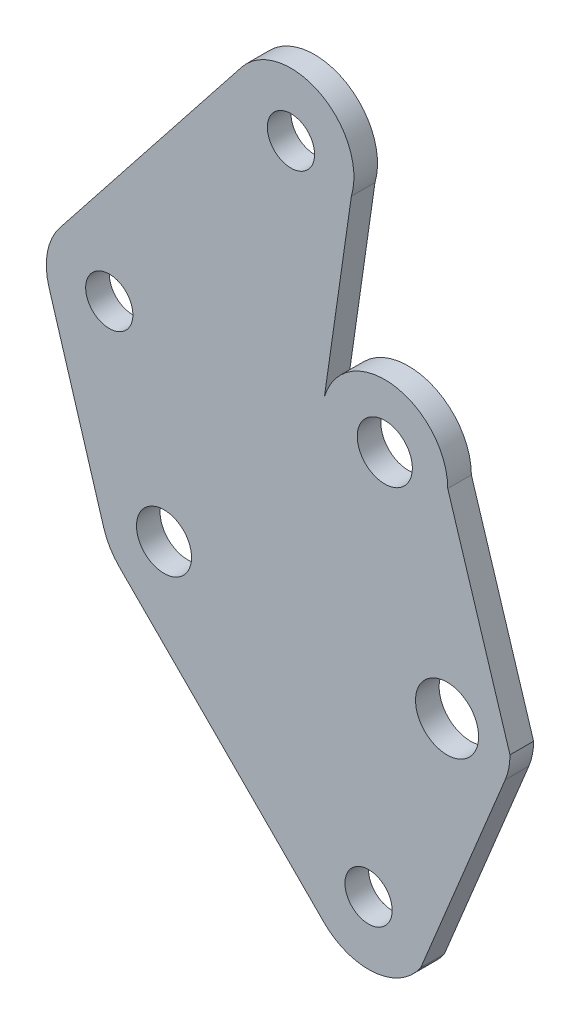
ISO-10303-21;
HEADER;
FILE_DESCRIPTION(('STEP AP214'),'2;1');
FILE_NAME('part.step','',(''),(''),'','','');
FILE_SCHEMA(('AUTOMOTIVE_DESIGN { 1 0 10303 214 1 1 1 1 }'));
ENDSEC;
DATA;
#1=APPLICATION_CONTEXT('core data for automotive mechanical design processes');
#2=APPLICATION_PROTOCOL_DEFINITION('international standard','automotive_design',2000,#1);
#3=PRODUCT_CONTEXT('',#1,'mechanical');
#4=PRODUCT('Part','Part','',(#3));
#5=PRODUCT_RELATED_PRODUCT_CATEGORY('part','',(#4));
#6=PRODUCT_DEFINITION_FORMATION('','',#4);
#7=PRODUCT_DEFINITION_CONTEXT('part definition',#1,'design');
#8=PRODUCT_DEFINITION('design','',#6,#7);
#9=PRODUCT_DEFINITION_SHAPE('','',#8);
#10=(LENGTH_UNIT() NAMED_UNIT(*) SI_UNIT(.MILLI.,.METRE.));
#11=(NAMED_UNIT(*) PLANE_ANGLE_UNIT() SI_UNIT($,.RADIAN.));
#12=(NAMED_UNIT(*) SI_UNIT($,.STERADIAN.) SOLID_ANGLE_UNIT());
#13=UNCERTAINTY_MEASURE_WITH_UNIT(LENGTH_MEASURE(1.E-05),#10,'distance_accuracy_value','');
#14=(GEOMETRIC_REPRESENTATION_CONTEXT(3) GLOBAL_UNCERTAINTY_ASSIGNED_CONTEXT((#13)) GLOBAL_UNIT_ASSIGNED_CONTEXT((#10,
#11,#12)) REPRESENTATION_CONTEXT('',''));
#15=CARTESIAN_POINT('',(0.,0.,0.));
#16=DIRECTION('',(0.,0.,1.));
#17=DIRECTION('',(1.,0.,0.));
#18=AXIS2_PLACEMENT_3D('',#15,#16,#17);
#19=CARTESIAN_POINT('',(480.966099188787,-500.48321627887,1.5));
#20=DIRECTION('',(0.,0.,1.));
#21=DIRECTION('',(1.,0.,0.));
#22=AXIS2_PLACEMENT_3D('',#19,#20,#21);
#23=PLANE('',#22);
#24=CARTESIAN_POINT('',(480.966099188787,-500.48321627887,1.5));
#25=DIRECTION('',(0.,0.,1.));
#26=DIRECTION('',(1.,0.,0.));
#27=AXIS2_PLACEMENT_3D('',#24,#25,#26);
#28=CIRCLE('',#27,1.49999999997758);
#29=CARTESIAN_POINT('',(482.466099188765,-500.48321627887,1.5));
#30=VERTEX_POINT('',#29);
#31=EDGE_CURVE('E340',#30,#30,#28,.T.);
#32=ORIENTED_EDGE('',*,*,#31,.F.);
#33=EDGE_LOOP('',(#32));
#34=FACE_BOUND('',#33,.T.);
#35=CARTESIAN_POINT('',(498.472829472805,-500.037769056651,1.5));
#36=DIRECTION('',(0.,0.,1.));
#37=DIRECTION('',(1.,0.,0.));
#38=AXIS2_PLACEMENT_3D('',#35,#36,#37);
#39=CIRCLE('',#38,1.74999999999998);
#40=CARTESIAN_POINT('',(500.222829472805,-500.037769056651,1.5));
#41=VERTEX_POINT('',#40);
#42=EDGE_CURVE('E356',#41,#41,#39,.T.);
#43=ORIENTED_EDGE('',*,*,#42,.F.);
#44=EDGE_LOOP('',(#43));
#45=FACE_BOUND('',#44,.T.);
#46=CARTESIAN_POINT('',(502.428285493923,-512.712031879607,1.5));
#47=DIRECTION('',(0.,0.,1.));
#48=DIRECTION('',(1.,0.,0.));
#49=AXIS2_PLACEMENT_3D('',#46,#47,#48);
#50=CIRCLE('',#49,2.00394401420554);
#51=CARTESIAN_POINT('',(504.432229508129,-512.712031879607,1.5));
#52=VERTEX_POINT('',#51);
#53=EDGE_CURVE('E170',#52,#52,#50,.T.);
#54=ORIENTED_EDGE('',*,*,#53,.F.);
#55=EDGE_LOOP('',(#54));
#56=FACE_BOUND('',#55,.T.);
#57=CARTESIAN_POINT('',(480.966099188787,-500.48321627887,1.5));
#58=DIRECTION('',(0.,0.,1.));
#59=DIRECTION('',(1.,0.,0.));
#60=AXIS2_PLACEMENT_3D('',#57,#58,#59);
#61=CIRCLE('',#60,4.00000000000006);
#62=CARTESIAN_POINT('',(477.828364409827,-498.002365526225,1.5));
#63=VERTEX_POINT('',#62);
#64=CARTESIAN_POINT('',(477.13774612288,-501.642402546369,1.5));
#65=VERTEX_POINT('',#64);
#66=EDGE_CURVE('E200',#63,#65,#61,.T.);
#67=ORIENTED_EDGE('',*,*,#66,.T.);
#68=DIRECTION('',(0.289796566874488,-0.957088266476901,0.));
#69=VECTOR('',#68,1.);
#70=CARTESIAN_POINT('',(480.615305213247,-513.127462694828,1.5));
#71=LINE('',#70,#69);
#72=CARTESIAN_POINT('',(480.615305213247,-513.127462694828,1.5));
#73=VERTEX_POINT('',#72);
#74=EDGE_CURVE('E112',#65,#73,#71,.T.);
#75=ORIENTED_EDGE('',*,*,#74,.T.);
#76=CARTESIAN_POINT('',(484.443657551073,-511.968276647786,1.5));
#77=DIRECTION('',(0.,0.,1.));
#78=DIRECTION('',(1.,0.,0.));
#79=AXIS2_PLACEMENT_3D('',#76,#77,#78);
#80=CIRCLE('',#79,3.99999923927427);
#81=CARTESIAN_POINT('',(481.609593026479,-514.791054036216,1.5));
#82=VERTEX_POINT('',#81);
#83=EDGE_CURVE('E237',#73,#82,#80,.T.);
#84=ORIENTED_EDGE('',*,*,#83,.T.);
#85=DIRECTION('',(0.705694481317502,-0.708516265895161,0.));
#86=VECTOR('',#85,1.);
#87=CARTESIAN_POINT('',(494.605769137307,-527.839196557848,1.5));
#88=LINE('',#87,#86);
#89=CARTESIAN_POINT('',(494.605769137307,-527.839196557848,1.5));
#90=VERTEX_POINT('',#89);
#91=EDGE_CURVE('E257',#82,#90,#88,.T.);
#92=ORIENTED_EDGE('',*,*,#91,.T.);
#93=CARTESIAN_POINT('',(497.439834468499,-525.016418366032,1.5));
#94=DIRECTION('',(0.,0.,1.));
#95=DIRECTION('',(1.,0.,0.));
#96=AXIS2_PLACEMENT_3D('',#93,#94,#95);
#97=CIRCLE('',#96,4.00000037770706);
#98=CARTESIAN_POINT('',(500.76062790589,-527.246291449381,1.5));
#99=VERTEX_POINT('',#98);
#100=EDGE_CURVE('E253',#90,#99,#97,.T.);
#101=ORIENTED_EDGE('',*,*,#100,.T.);
#102=DIRECTION('',(0.381124728494822,0.924523629405841,0.));
#103=VECTOR('',#102,1.);
#104=CARTESIAN_POINT('',(500.76062790589,-527.246291449381,1.5));
#105=LINE('',#104,#103);
#106=CARTESIAN_POINT('',(506.124139785868,-514.235607285114,1.5));
#107=VERTEX_POINT('',#106);
#108=EDGE_CURVE('E256',#99,#107,#105,.T.);
#109=ORIENTED_EDGE('',*,*,#108,.T.);
#110=CARTESIAN_POINT('',(502.428285493923,-512.712031879607,1.5));
#111=DIRECTION('',(0.,0.,1.));
#112=DIRECTION('',(1.,0.,0.));
#113=AXIS2_PLACEMENT_3D('',#110,#111,#112);
#114=CIRCLE('',#113,3.99757688650861);
#115=CARTESIAN_POINT('',(506.425862380432,-512.712031879605,1.5));
#116=VERTEX_POINT('',#115);
#117=EDGE_CURVE('E261',#107,#116,#114,.T.);
#118=ORIENTED_EDGE('',*,*,#117,.T.);
#119=DIRECTION('',(-0.297748340198282,0.954644397621003,0.));
#120=VECTOR('',#119,1.);
#121=CARTESIAN_POINT('',(502.472829472917,-500.037769056651,1.5));
#122=LINE('',#121,#120);
#123=CARTESIAN_POINT('',(502.472829472917,-500.037769056651,1.5));
#124=VERTEX_POINT('',#123);
#125=EDGE_CURVE('E268',#116,#124,#122,.T.);
#126=ORIENTED_EDGE('',*,*,#125,.T.);
#127=CARTESIAN_POINT('',(498.472829472805,-500.037769056651,1.5));
#128=DIRECTION('',(0.,0.,1.));
#129=DIRECTION('',(1.,0.,0.));
#130=AXIS2_PLACEMENT_3D('',#127,#128,#129);
#131=CIRCLE('',#130,4.00000000011155);
#132=CARTESIAN_POINT('',(494.635210185155,-498.909638654637,1.5));
#133=VERTEX_POINT('',#132);
#134=EDGE_CURVE('E143',#124,#133,#131,.T.);
#135=ORIENTED_EDGE('',*,*,#134,.T.);
#136=DIRECTION('',(0.14246759367458,0.989799466938922,0.));
#137=VECTOR('',#136,1.);
#138=CARTESIAN_POINT('',(496.347682497551,-487.012166827967,1.5));
#139=LINE('',#138,#137);
#140=CARTESIAN_POINT('',(496.347682497551,-487.012166827967,1.5));
#141=VERTEX_POINT('',#140);
#142=EDGE_CURVE('E137',#133,#141,#139,.T.);
#143=ORIENTED_EDGE('',*,*,#142,.T.);
#144=CARTESIAN_POINT('',(492.509632998113,-485.88389505921,1.5));
#145=DIRECTION('',(0.,0.,1.));
#146=DIRECTION('',(1.,0.,0.));
#147=AXIS2_PLACEMENT_3D('',#144,#145,#146);
#148=CIRCLE('',#147,4.0004526174307);
#149=CARTESIAN_POINT('',(489.371543170789,-483.402763587491,1.5));
#150=VERTEX_POINT('',#149);
#151=EDGE_CURVE('E141',#141,#150,#148,.T.);
#152=ORIENTED_EDGE('',*,*,#151,.T.);
#153=DIRECTION('',(-0.620212688161335,-0.784433694740155,0.));
#154=VECTOR('',#153,1.);
#155=CARTESIAN_POINT('',(477.828364409827,-498.002365526225,1.5));
#156=LINE('',#155,#154);
#157=EDGE_CURVE('E57',#150,#63,#156,.T.);
#158=ORIENTED_EDGE('',*,*,#157,.T.);
#159=EDGE_LOOP('',(#67,#75,#84,#92,#101,#109,#118,#126,#135,#143,#152,#158));
#160=FACE_BOUND('',#159,.T.);
#161=CARTESIAN_POINT('',(497.439834468499,-525.016418366032,1.5));
#162=DIRECTION('',(0.,0.,1.));
#163=DIRECTION('',(1.,0.,0.));
#164=AXIS2_PLACEMENT_3D('',#161,#162,#163);
#165=CIRCLE('',#164,1.50000000009165);
#166=CARTESIAN_POINT('',(498.939834468591,-525.016418366032,1.5));
#167=VERTEX_POINT('',#166);
#168=EDGE_CURVE('E364',#167,#167,#165,.T.);
#169=ORIENTED_EDGE('',*,*,#168,.F.);
#170=EDGE_LOOP('',(#169));
#171=FACE_BOUND('',#170,.T.);
#172=CARTESIAN_POINT('',(492.509632998113,-485.88389505921,1.5));
#173=DIRECTION('',(0.,0.,1.));
#174=DIRECTION('',(1.,0.,0.));
#175=AXIS2_PLACEMENT_3D('',#172,#173,#174);
#176=CIRCLE('',#175,1.49999999994139);
#177=CARTESIAN_POINT('',(494.009632998054,-485.88389505921,1.5));
#178=VERTEX_POINT('',#177);
#179=EDGE_CURVE('E348',#178,#178,#176,.T.);
#180=ORIENTED_EDGE('',*,*,#179,.F.);
#181=EDGE_LOOP('',(#180));
#182=FACE_BOUND('',#181,.T.);
#183=CARTESIAN_POINT('',(484.443657551073,-511.968276647786,1.5));
#184=DIRECTION('',(0.,0.,1.));
#185=DIRECTION('',(1.,0.,0.));
#186=AXIS2_PLACEMENT_3D('',#183,#184,#185);
#187=CIRCLE('',#186,1.74999999999997);
#188=CARTESIAN_POINT('',(486.193657551073,-511.968276647786,1.5));
#189=VERTEX_POINT('',#188);
#190=EDGE_CURVE('E329',#189,#189,#187,.T.);
#191=ORIENTED_EDGE('',*,*,#190,.F.);
#192=EDGE_LOOP('',(#191));
#193=FACE_BOUND('',#192,.T.);
#194=ADVANCED_FACE('F39',(#34,#45,#56,#160,#171,#182,#193),#23,.T.);
#195=CARTESIAN_POINT('',(480.966099188787,-500.48321627887,0.));
#196=DIRECTION('',(0.,0.,1.));
#197=DIRECTION('',(1.,0.,0.));
#198=AXIS2_PLACEMENT_3D('',#195,#196,#197);
#199=PLANE('',#198);
#200=CARTESIAN_POINT('',(480.966099188787,-500.48321627887,0.));
#201=DIRECTION('',(0.,0.,1.));
#202=DIRECTION('',(1.,0.,0.));
#203=AXIS2_PLACEMENT_3D('',#200,#201,#202);
#204=CIRCLE('',#203,4.00000000000006);
#205=CARTESIAN_POINT('',(477.828364409827,-498.002365526225,0.));
#206=VERTEX_POINT('',#205);
#207=CARTESIAN_POINT('',(477.13774612288,-501.642402546369,0.));
#208=VERTEX_POINT('',#207);
#209=EDGE_CURVE('E165',#206,#208,#204,.T.);
#210=ORIENTED_EDGE('',*,*,#209,.F.);
#211=DIRECTION('',(-0.620212688161335,-0.784433694740155,0.));
#212=VECTOR('',#211,1.);
#213=CARTESIAN_POINT('',(477.828364409827,-498.002365526225,0.));
#214=LINE('',#213,#212);
#215=CARTESIAN_POINT('',(489.371543170789,-483.402763587491,0.));
#216=VERTEX_POINT('',#215);
#217=EDGE_CURVE('E104',#216,#206,#214,.T.);
#218=ORIENTED_EDGE('',*,*,#217,.F.);
#219=CARTESIAN_POINT('',(492.509632998113,-485.88389505921,0.));
#220=DIRECTION('',(0.,0.,1.));
#221=DIRECTION('',(1.,0.,0.));
#222=AXIS2_PLACEMENT_3D('',#219,#220,#221);
#223=CIRCLE('',#222,4.0004526174307);
#224=CARTESIAN_POINT('',(496.347682497551,-487.012166827967,0.));
#225=VERTEX_POINT('',#224);
#226=EDGE_CURVE('E98',#225,#216,#223,.T.);
#227=ORIENTED_EDGE('',*,*,#226,.F.);
#228=DIRECTION('',(0.14246759367458,0.989799466938922,0.));
#229=VECTOR('',#228,1.);
#230=CARTESIAN_POINT('',(496.347682497551,-487.012166827967,0.));
#231=LINE('',#230,#229);
#232=CARTESIAN_POINT('',(494.635210185155,-498.909638654637,0.));
#233=VERTEX_POINT('',#232);
#234=EDGE_CURVE('E152',#233,#225,#231,.T.);
#235=ORIENTED_EDGE('',*,*,#234,.F.);
#236=CARTESIAN_POINT('',(498.472829472805,-500.037769056651,0.));
#237=DIRECTION('',(0.,0.,1.));
#238=DIRECTION('',(1.,0.,0.));
#239=AXIS2_PLACEMENT_3D('',#236,#237,#238);
#240=CIRCLE('',#239,4.00000000011155);
#241=CARTESIAN_POINT('',(502.472829472917,-500.037769056651,0.));
#242=VERTEX_POINT('',#241);
#243=EDGE_CURVE('E191',#242,#233,#240,.T.);
#244=ORIENTED_EDGE('',*,*,#243,.F.);
#245=DIRECTION('',(-0.297748340198282,0.954644397621003,0.));
#246=VECTOR('',#245,1.);
#247=CARTESIAN_POINT('',(502.472829472917,-500.037769056651,0.));
#248=LINE('',#247,#246);
#249=CARTESIAN_POINT('',(506.425862380432,-512.712031879605,0.));
#250=VERTEX_POINT('',#249);
#251=EDGE_CURVE('E188',#250,#242,#248,.T.);
#252=ORIENTED_EDGE('',*,*,#251,.F.);
#253=CARTESIAN_POINT('',(502.428285493923,-512.712031879607,0.));
#254=DIRECTION('',(0.,0.,1.));
#255=DIRECTION('',(1.,0.,0.));
#256=AXIS2_PLACEMENT_3D('',#253,#254,#255);
#257=CIRCLE('',#256,3.99757688650861);
#258=CARTESIAN_POINT('',(506.124139785868,-514.235607285114,0.));
#259=VERTEX_POINT('',#258);
#260=EDGE_CURVE('E185',#259,#250,#257,.T.);
#261=ORIENTED_EDGE('',*,*,#260,.F.);
#262=DIRECTION('',(0.381124728494822,0.924523629405841,0.));
#263=VECTOR('',#262,1.);
#264=CARTESIAN_POINT('',(500.76062790589,-527.246291449381,0.));
#265=LINE('',#264,#263);
#266=CARTESIAN_POINT('',(500.76062790589,-527.246291449381,0.));
#267=VERTEX_POINT('',#266);
#268=EDGE_CURVE('E182',#267,#259,#265,.T.);
#269=ORIENTED_EDGE('',*,*,#268,.F.);
#270=CARTESIAN_POINT('',(497.439834468499,-525.016418366032,0.));
#271=DIRECTION('',(0.,0.,1.));
#272=DIRECTION('',(1.,0.,0.));
#273=AXIS2_PLACEMENT_3D('',#270,#271,#272);
#274=CIRCLE('',#273,4.00000037770706);
#275=CARTESIAN_POINT('',(494.605769137307,-527.839196557848,0.));
#276=VERTEX_POINT('',#275);
#277=EDGE_CURVE('E179',#276,#267,#274,.T.);
#278=ORIENTED_EDGE('',*,*,#277,.F.);
#279=DIRECTION('',(0.705694481317502,-0.708516265895161,0.));
#280=VECTOR('',#279,1.);
#281=CARTESIAN_POINT('',(494.605769137307,-527.839196557848,0.));
#282=LINE('',#281,#280);
#283=CARTESIAN_POINT('',(481.609593026479,-514.791054036216,0.));
#284=VERTEX_POINT('',#283);
#285=EDGE_CURVE('E176',#284,#276,#282,.T.);
#286=ORIENTED_EDGE('',*,*,#285,.F.);
#287=CARTESIAN_POINT('',(484.443657551073,-511.968276647786,0.));
#288=DIRECTION('',(0.,0.,1.));
#289=DIRECTION('',(1.,0.,0.));
#290=AXIS2_PLACEMENT_3D('',#287,#288,#289);
#291=CIRCLE('',#290,3.99999923927427);
#292=CARTESIAN_POINT('',(480.615305213247,-513.127462694828,0.));
#293=VERTEX_POINT('',#292);
#294=EDGE_CURVE('E173',#293,#284,#291,.T.);
#295=ORIENTED_EDGE('',*,*,#294,.F.);
#296=DIRECTION('',(0.289796566874488,-0.957088266476901,0.));
#297=VECTOR('',#296,1.);
#298=CARTESIAN_POINT('',(480.615305213247,-513.127462694828,0.));
#299=LINE('',#298,#297);
#300=EDGE_CURVE('E169',#208,#293,#299,.T.);
#301=ORIENTED_EDGE('',*,*,#300,.F.);
#302=EDGE_LOOP('',(#210,#218,#227,#235,#244,#252,#261,#269,#278,#286,#295,#301));
#303=FACE_BOUND('',#302,.T.);
#304=CARTESIAN_POINT('',(502.428285493923,-512.712031879607,0.));
#305=DIRECTION('',(0.,0.,1.));
#306=DIRECTION('',(1.,0.,0.));
#307=AXIS2_PLACEMENT_3D('',#304,#305,#306);
#308=CIRCLE('',#307,2.00394401420554);
#309=CARTESIAN_POINT('',(504.432229508129,-512.712031879607,0.));
#310=VERTEX_POINT('',#309);
#311=EDGE_CURVE('E368',#310,#310,#308,.T.);
#312=ORIENTED_EDGE('',*,*,#311,.T.);
#313=EDGE_LOOP('',(#312));
#314=FACE_BOUND('',#313,.T.);
#315=CARTESIAN_POINT('',(497.439834468499,-525.016418366032,0.));
#316=DIRECTION('',(0.,0.,1.));
#317=DIRECTION('',(1.,0.,0.));
#318=AXIS2_PLACEMENT_3D('',#315,#316,#317);
#319=CIRCLE('',#318,1.50000000009165);
#320=CARTESIAN_POINT('',(498.939834468591,-525.016418366032,0.));
#321=VERTEX_POINT('',#320);
#322=EDGE_CURVE('E360',#321,#321,#319,.T.);
#323=ORIENTED_EDGE('',*,*,#322,.T.);
#324=EDGE_LOOP('',(#323));
#325=FACE_BOUND('',#324,.T.);
#326=CARTESIAN_POINT('',(498.472829472805,-500.037769056651,0.));
#327=DIRECTION('',(0.,0.,1.));
#328=DIRECTION('',(1.,0.,0.));
#329=AXIS2_PLACEMENT_3D('',#326,#327,#328);
#330=CIRCLE('',#329,1.74999999999998);
#331=CARTESIAN_POINT('',(500.222829472805,-500.037769056651,0.));
#332=VERTEX_POINT('',#331);
#333=EDGE_CURVE('E352',#332,#332,#330,.T.);
#334=ORIENTED_EDGE('',*,*,#333,.T.);
#335=EDGE_LOOP('',(#334));
#336=FACE_BOUND('',#335,.T.);
#337=CARTESIAN_POINT('',(492.509632998113,-485.88389505921,0.));
#338=DIRECTION('',(0.,0.,1.));
#339=DIRECTION('',(1.,0.,0.));
#340=AXIS2_PLACEMENT_3D('',#337,#338,#339);
#341=CIRCLE('',#340,1.49999999994139);
#342=CARTESIAN_POINT('',(494.009632998054,-485.88389505921,0.));
#343=VERTEX_POINT('',#342);
#344=EDGE_CURVE('E344',#343,#343,#341,.T.);
#345=ORIENTED_EDGE('',*,*,#344,.T.);
#346=EDGE_LOOP('',(#345));
#347=FACE_BOUND('',#346,.T.);
#348=CARTESIAN_POINT('',(480.966099188787,-500.48321627887,0.));
#349=DIRECTION('',(0.,0.,1.));
#350=DIRECTION('',(1.,0.,0.));
#351=AXIS2_PLACEMENT_3D('',#348,#349,#350);
#352=CIRCLE('',#351,1.49999999997758);
#353=CARTESIAN_POINT('',(482.466099188765,-500.48321627887,0.));
#354=VERTEX_POINT('',#353);
#355=EDGE_CURVE('E337',#354,#354,#352,.T.);
#356=ORIENTED_EDGE('',*,*,#355,.T.);
#357=EDGE_LOOP('',(#356));
#358=FACE_BOUND('',#357,.T.);
#359=CARTESIAN_POINT('',(484.443657551073,-511.968276647786,0.));
#360=DIRECTION('',(0.,0.,1.));
#361=DIRECTION('',(1.,0.,0.));
#362=AXIS2_PLACEMENT_3D('',#359,#360,#361);
#363=CIRCLE('',#362,1.74999999999997);
#364=CARTESIAN_POINT('',(486.193657551073,-511.968276647786,0.));
#365=VERTEX_POINT('',#364);
#366=EDGE_CURVE('E332',#365,#365,#363,.T.);
#367=ORIENTED_EDGE('',*,*,#366,.T.);
#368=EDGE_LOOP('',(#367));
#369=FACE_BOUND('',#368,.T.);
#370=ADVANCED_FACE('F241',(#303,#314,#325,#336,#347,#358,#369),#199,.F.);
#371=CARTESIAN_POINT('',(480.966099188787,-500.48321627887,1.5));
#372=DIRECTION('',(0.,0.,-1.));
#373=DIRECTION('',(-1.,0.,0.));
#374=AXIS2_PLACEMENT_3D('',#371,#372,#373);
#375=CYLINDRICAL_SURFACE('',#374,4.00000000000006);
#376=ORIENTED_EDGE('',*,*,#209,.T.);
#377=DIRECTION('',(0.,0.,-1.));
#378=VECTOR('',#377,1.);
#379=CARTESIAN_POINT('',(477.13774612288,-501.642402546369,1.5));
#380=LINE('',#379,#378);
#381=EDGE_CURVE('E11',#65,#208,#380,.T.);
#382=ORIENTED_EDGE('',*,*,#381,.F.);
#383=ORIENTED_EDGE('',*,*,#66,.F.);
#384=DIRECTION('',(0.,0.,-1.));
#385=VECTOR('',#384,1.);
#386=CARTESIAN_POINT('',(477.828364409827,-498.002365526225,1.5));
#387=LINE('',#386,#385);
#388=EDGE_CURVE('E161',#63,#206,#387,.T.);
#389=ORIENTED_EDGE('',*,*,#388,.T.);
#390=EDGE_LOOP('',(#376,#382,#383,#389));
#391=FACE_BOUND('',#390,.T.);
#392=ADVANCED_FACE('F41',(#391),#375,.T.);
#393=CARTESIAN_POINT('',(480.615305213247,-513.127462694828,1.5));
#394=DIRECTION('',(0.957088266476901,0.289796566874488,0.));
#395=DIRECTION('',(-0.289796566874488,0.957088266476901,0.));
#396=AXIS2_PLACEMENT_3D('',#393,#394,#395);
#397=PLANE('',#396);
#398=ORIENTED_EDGE('',*,*,#300,.T.);
#399=DIRECTION('',(0.,0.,-1.));
#400=VECTOR('',#399,1.);
#401=CARTESIAN_POINT('',(480.615305213247,-513.127462694828,1.5));
#402=LINE('',#401,#400);
#403=EDGE_CURVE('E49',#73,#293,#402,.T.);
#404=ORIENTED_EDGE('',*,*,#403,.F.);
#405=ORIENTED_EDGE('',*,*,#74,.F.);
#406=ORIENTED_EDGE('',*,*,#381,.T.);
#407=EDGE_LOOP('',(#398,#404,#405,#406));
#408=FACE_BOUND('',#407,.T.);
#409=ADVANCED_FACE('F502',(#408),#397,.F.);
#410=CARTESIAN_POINT('',(484.443657551073,-511.968276647786,1.5));
#411=DIRECTION('',(0.,0.,-1.));
#412=DIRECTION('',(-1.,0.,0.));
#413=AXIS2_PLACEMENT_3D('',#410,#411,#412);
#414=CYLINDRICAL_SURFACE('',#413,3.99999923927427);
#415=ORIENTED_EDGE('',*,*,#294,.T.);
#416=DIRECTION('',(0.,0.,-1.));
#417=VECTOR('',#416,1.);
#418=CARTESIAN_POINT('',(481.609593026479,-514.791054036216,1.5));
#419=LINE('',#418,#417);
#420=EDGE_CURVE('E227',#82,#284,#419,.T.);
#421=ORIENTED_EDGE('',*,*,#420,.F.);
#422=ORIENTED_EDGE('',*,*,#83,.F.);
#423=ORIENTED_EDGE('',*,*,#403,.T.);
#424=EDGE_LOOP('',(#415,#421,#422,#423));
#425=FACE_BOUND('',#424,.T.);
#426=ADVANCED_FACE('F235',(#425),#414,.T.);
#427=CARTESIAN_POINT('',(494.605769137307,-527.839196557848,1.5));
#428=DIRECTION('',(0.708516265895161,0.705694481317502,0.));
#429=DIRECTION('',(-0.705694481317502,0.708516265895161,0.));
#430=AXIS2_PLACEMENT_3D('',#427,#428,#429);
#431=PLANE('',#430);
#432=ORIENTED_EDGE('',*,*,#285,.T.);
#433=DIRECTION('',(0.,0.,-1.));
#434=VECTOR('',#433,1.);
#435=CARTESIAN_POINT('',(494.605769137307,-527.839196557848,1.5));
#436=LINE('',#435,#434);
#437=EDGE_CURVE('E223',#90,#276,#436,.T.);
#438=ORIENTED_EDGE('',*,*,#437,.F.);
#439=ORIENTED_EDGE('',*,*,#91,.F.);
#440=ORIENTED_EDGE('',*,*,#420,.T.);
#441=EDGE_LOOP('',(#432,#438,#439,#440));
#442=FACE_BOUND('',#441,.T.);
#443=ADVANCED_FACE('F247',(#442),#431,.F.);
#444=CARTESIAN_POINT('',(497.439834468499,-525.016418366032,1.5));
#445=DIRECTION('',(0.,0.,-1.));
#446=DIRECTION('',(-1.,0.,0.));
#447=AXIS2_PLACEMENT_3D('',#444,#445,#446);
#448=CYLINDRICAL_SURFACE('',#447,4.00000037770706);
#449=ORIENTED_EDGE('',*,*,#277,.T.);
#450=DIRECTION('',(0.,0.,-1.));
#451=VECTOR('',#450,1.);
#452=CARTESIAN_POINT('',(500.76062790589,-527.246291449381,1.5));
#453=LINE('',#452,#451);
#454=EDGE_CURVE('E219',#99,#267,#453,.T.);
#455=ORIENTED_EDGE('',*,*,#454,.F.);
#456=ORIENTED_EDGE('',*,*,#100,.F.);
#457=ORIENTED_EDGE('',*,*,#437,.T.);
#458=EDGE_LOOP('',(#449,#455,#456,#457));
#459=FACE_BOUND('',#458,.T.);
#460=ADVANCED_FACE('F251',(#459),#448,.T.);
#461=CARTESIAN_POINT('',(500.76062790589,-527.246291449381,1.5));
#462=DIRECTION('',(-0.92452362940584,0.381124728494822,0.));
#463=DIRECTION('',(-0.381124728494822,-0.924523629405841,0.));
#464=AXIS2_PLACEMENT_3D('',#461,#462,#463);
#465=PLANE('',#464);
#466=ORIENTED_EDGE('',*,*,#268,.T.);
#467=DIRECTION('',(0.,0.,-1.));
#468=VECTOR('',#467,1.);
#469=CARTESIAN_POINT('',(506.124139785868,-514.235607285114,1.5));
#470=LINE('',#469,#468);
#471=EDGE_CURVE('E215',#107,#259,#470,.T.);
#472=ORIENTED_EDGE('',*,*,#471,.F.);
#473=ORIENTED_EDGE('',*,*,#108,.F.);
#474=ORIENTED_EDGE('',*,*,#454,.T.);
#475=EDGE_LOOP('',(#466,#472,#473,#474));
#476=FACE_BOUND('',#475,.T.);
#477=ADVANCED_FACE('F467',(#476),#465,.F.);
#478=CARTESIAN_POINT('',(502.428285493923,-512.712031879607,1.5));
#479=DIRECTION('',(0.,0.,-1.));
#480=DIRECTION('',(-1.,0.,0.));
#481=AXIS2_PLACEMENT_3D('',#478,#479,#480);
#482=CYLINDRICAL_SURFACE('',#481,3.99757688650861);
#483=ORIENTED_EDGE('',*,*,#260,.T.);
#484=DIRECTION('',(0.,0.,-1.));
#485=VECTOR('',#484,1.);
#486=CARTESIAN_POINT('',(506.425862380432,-512.712031879605,1.5));
#487=LINE('',#486,#485);
#488=EDGE_CURVE('E211',#116,#250,#487,.T.);
#489=ORIENTED_EDGE('',*,*,#488,.F.);
#490=ORIENTED_EDGE('',*,*,#117,.F.);
#491=ORIENTED_EDGE('',*,*,#471,.T.);
#492=EDGE_LOOP('',(#483,#489,#490,#491));
#493=FACE_BOUND('',#492,.T.);
#494=ADVANCED_FACE('F458',(#493),#482,.T.);
#495=CARTESIAN_POINT('',(502.472829472917,-500.037769056651,1.5));
#496=DIRECTION('',(-0.954644397621003,-0.297748340198282,0.));
#497=DIRECTION('',(0.297748340198282,-0.954644397621003,0.));
#498=AXIS2_PLACEMENT_3D('',#495,#496,#497);
#499=PLANE('',#498);
#500=ORIENTED_EDGE('',*,*,#251,.T.);
#501=DIRECTION('',(0.,0.,-1.));
#502=VECTOR('',#501,1.);
#503=CARTESIAN_POINT('',(502.472829472917,-500.037769056651,1.5));
#504=LINE('',#503,#502);
#505=EDGE_CURVE('E207',#124,#242,#504,.T.);
#506=ORIENTED_EDGE('',*,*,#505,.F.);
#507=ORIENTED_EDGE('',*,*,#125,.F.);
#508=ORIENTED_EDGE('',*,*,#488,.T.);
#509=EDGE_LOOP('',(#500,#506,#507,#508));
#510=FACE_BOUND('',#509,.T.);
#511=ADVANCED_FACE('F276',(#510),#499,.F.);
#512=CARTESIAN_POINT('',(498.472829472805,-500.037769056651,1.5));
#513=DIRECTION('',(0.,0.,-1.));
#514=DIRECTION('',(-1.,0.,0.));
#515=AXIS2_PLACEMENT_3D('',#512,#513,#514);
#516=CYLINDRICAL_SURFACE('',#515,4.00000000011155);
#517=ORIENTED_EDGE('',*,*,#243,.T.);
#518=DIRECTION('',(0.,0.,-1.));
#519=VECTOR('',#518,1.);
#520=CARTESIAN_POINT('',(494.635210185155,-498.909638654637,1.5));
#521=LINE('',#520,#519);
#522=EDGE_CURVE('E154',#133,#233,#521,.T.);
#523=ORIENTED_EDGE('',*,*,#522,.F.);
#524=ORIENTED_EDGE('',*,*,#134,.F.);
#525=ORIENTED_EDGE('',*,*,#505,.T.);
#526=EDGE_LOOP('',(#517,#523,#524,#525));
#527=FACE_BOUND('',#526,.T.);
#528=ADVANCED_FACE('F280',(#527),#516,.T.);
#529=CARTESIAN_POINT('',(496.347682497551,-487.012166827967,1.5));
#530=DIRECTION('',(-0.989799466938922,0.14246759367458,0.));
#531=DIRECTION('',(-0.14246759367458,-0.989799466938922,0.));
#532=AXIS2_PLACEMENT_3D('',#529,#530,#531);
#533=PLANE('',#532);
#534=ORIENTED_EDGE('',*,*,#234,.T.);
#535=DIRECTION('',(0.,0.,-1.));
#536=VECTOR('',#535,1.);
#537=CARTESIAN_POINT('',(496.347682497551,-487.012166827967,1.5));
#538=LINE('',#537,#536);
#539=EDGE_CURVE('E149',#141,#225,#538,.T.);
#540=ORIENTED_EDGE('',*,*,#539,.F.);
#541=ORIENTED_EDGE('',*,*,#142,.F.);
#542=ORIENTED_EDGE('',*,*,#522,.T.);
#543=EDGE_LOOP('',(#534,#540,#541,#542));
#544=FACE_BOUND('',#543,.T.);
#545=ADVANCED_FACE('F150',(#544),#533,.F.);
#546=CARTESIAN_POINT('',(492.509632998113,-485.88389505921,1.5));
#547=DIRECTION('',(0.,0.,-1.));
#548=DIRECTION('',(-1.,0.,0.));
#549=AXIS2_PLACEMENT_3D('',#546,#547,#548);
#550=CYLINDRICAL_SURFACE('',#549,4.0004526174307);
#551=ORIENTED_EDGE('',*,*,#226,.T.);
#552=DIRECTION('',(0.,0.,-1.));
#553=VECTOR('',#552,1.);
#554=CARTESIAN_POINT('',(489.371543170789,-483.402763587491,1.5));
#555=LINE('',#554,#553);
#556=EDGE_CURVE('E155',#150,#216,#555,.T.);
#557=ORIENTED_EDGE('',*,*,#556,.F.);
#558=ORIENTED_EDGE('',*,*,#151,.F.);
#559=ORIENTED_EDGE('',*,*,#539,.T.);
#560=EDGE_LOOP('',(#551,#557,#558,#559));
#561=FACE_BOUND('',#560,.T.);
#562=ADVANCED_FACE('F157',(#561),#550,.T.);
#563=CARTESIAN_POINT('',(477.828364409827,-498.002365526225,1.5));
#564=DIRECTION('',(0.784433694740155,-0.620212688161335,0.));
#565=DIRECTION('',(0.620212688161335,0.784433694740155,0.));
#566=AXIS2_PLACEMENT_3D('',#563,#564,#565);
#567=PLANE('',#566);
#568=ORIENTED_EDGE('',*,*,#217,.T.);
#569=ORIENTED_EDGE('',*,*,#388,.F.);
#570=ORIENTED_EDGE('',*,*,#157,.F.);
#571=ORIENTED_EDGE('',*,*,#556,.T.);
#572=EDGE_LOOP('',(#568,#569,#570,#571));
#573=FACE_BOUND('',#572,.T.);
#574=ADVANCED_FACE('F284',(#573),#567,.F.);
#575=CARTESIAN_POINT('',(502.428285493923,-512.712031879607,1.5));
#576=DIRECTION('',(0.,0.,-1.));
#577=DIRECTION('',(-1.,0.,0.));
#578=AXIS2_PLACEMENT_3D('',#575,#576,#577);
#579=CYLINDRICAL_SURFACE('',#578,2.00394401420554);
#580=ORIENTED_EDGE('',*,*,#53,.T.);
#581=EDGE_LOOP('',(#580));
#582=FACE_BOUND('',#581,.T.);
#583=ORIENTED_EDGE('',*,*,#311,.F.);
#584=EDGE_LOOP('',(#583));
#585=FACE_BOUND('',#584,.T.);
#586=ADVANCED_FACE('F286',(#582,#585),#579,.F.);
#587=CARTESIAN_POINT('',(497.439834468499,-525.016418366032,1.5));
#588=DIRECTION('',(0.,0.,-1.));
#589=DIRECTION('',(-1.,0.,0.));
#590=AXIS2_PLACEMENT_3D('',#587,#588,#589);
#591=CYLINDRICAL_SURFACE('',#590,1.50000000009165);
#592=ORIENTED_EDGE('',*,*,#168,.T.);
#593=EDGE_LOOP('',(#592));
#594=FACE_BOUND('',#593,.T.);
#595=ORIENTED_EDGE('',*,*,#322,.F.);
#596=EDGE_LOOP('',(#595));
#597=FACE_BOUND('',#596,.T.);
#598=ADVANCED_FACE('F292',(#594,#597),#591,.F.);
#599=CARTESIAN_POINT('',(498.472829472805,-500.037769056651,1.5));
#600=DIRECTION('',(0.,0.,-1.));
#601=DIRECTION('',(-1.,0.,0.));
#602=AXIS2_PLACEMENT_3D('',#599,#600,#601);
#603=CYLINDRICAL_SURFACE('',#602,1.74999999999998);
#604=ORIENTED_EDGE('',*,*,#42,.T.);
#605=EDGE_LOOP('',(#604));
#606=FACE_BOUND('',#605,.T.);
#607=ORIENTED_EDGE('',*,*,#333,.F.);
#608=EDGE_LOOP('',(#607));
#609=FACE_BOUND('',#608,.T.);
#610=ADVANCED_FACE('F308',(#606,#609),#603,.F.);
#611=CARTESIAN_POINT('',(492.509632998113,-485.88389505921,1.5));
#612=DIRECTION('',(0.,0.,-1.));
#613=DIRECTION('',(-1.,0.,0.));
#614=AXIS2_PLACEMENT_3D('',#611,#612,#613);
#615=CYLINDRICAL_SURFACE('',#614,1.49999999994139);
#616=ORIENTED_EDGE('',*,*,#179,.T.);
#617=EDGE_LOOP('',(#616));
#618=FACE_BOUND('',#617,.T.);
#619=ORIENTED_EDGE('',*,*,#344,.F.);
#620=EDGE_LOOP('',(#619));
#621=FACE_BOUND('',#620,.T.);
#622=ADVANCED_FACE('F312',(#618,#621),#615,.F.);
#623=CARTESIAN_POINT('',(480.966099188787,-500.48321627887,1.5));
#624=DIRECTION('',(0.,0.,-1.));
#625=DIRECTION('',(-1.,0.,0.));
#626=AXIS2_PLACEMENT_3D('',#623,#624,#625);
#627=CYLINDRICAL_SURFACE('',#626,1.49999999997758);
#628=ORIENTED_EDGE('',*,*,#31,.T.);
#629=EDGE_LOOP('',(#628));
#630=FACE_BOUND('',#629,.T.);
#631=ORIENTED_EDGE('',*,*,#355,.F.);
#632=EDGE_LOOP('',(#631));
#633=FACE_BOUND('',#632,.T.);
#634=ADVANCED_FACE('F316',(#630,#633),#627,.F.);
#635=CARTESIAN_POINT('',(484.443657551073,-511.968276647786,1.5));
#636=DIRECTION('',(0.,0.,-1.));
#637=DIRECTION('',(-1.,0.,0.));
#638=AXIS2_PLACEMENT_3D('',#635,#636,#637);
#639=CYLINDRICAL_SURFACE('',#638,1.74999999999997);
#640=ORIENTED_EDGE('',*,*,#190,.T.);
#641=EDGE_LOOP('',(#640));
#642=FACE_BOUND('',#641,.T.);
#643=ORIENTED_EDGE('',*,*,#366,.F.);
#644=EDGE_LOOP('',(#643));
#645=FACE_BOUND('',#644,.T.);
#646=ADVANCED_FACE('F320',(#642,#645),#639,.F.);
#647=CLOSED_SHELL('',(#194,#370,#392,#409,#426,#443,#460,#477,#494,#511,#528,#545,#562,#574,
#586,#598,#610,#622,#634,#646));
#648=MANIFOLD_SOLID_BREP('B2',#647);
#649=ADVANCED_BREP_SHAPE_REPRESENTATION('',(#18,#648),#14);
#650=SHAPE_DEFINITION_REPRESENTATION(#9,#649);
ENDSEC;
END-ISO-10303-21;
